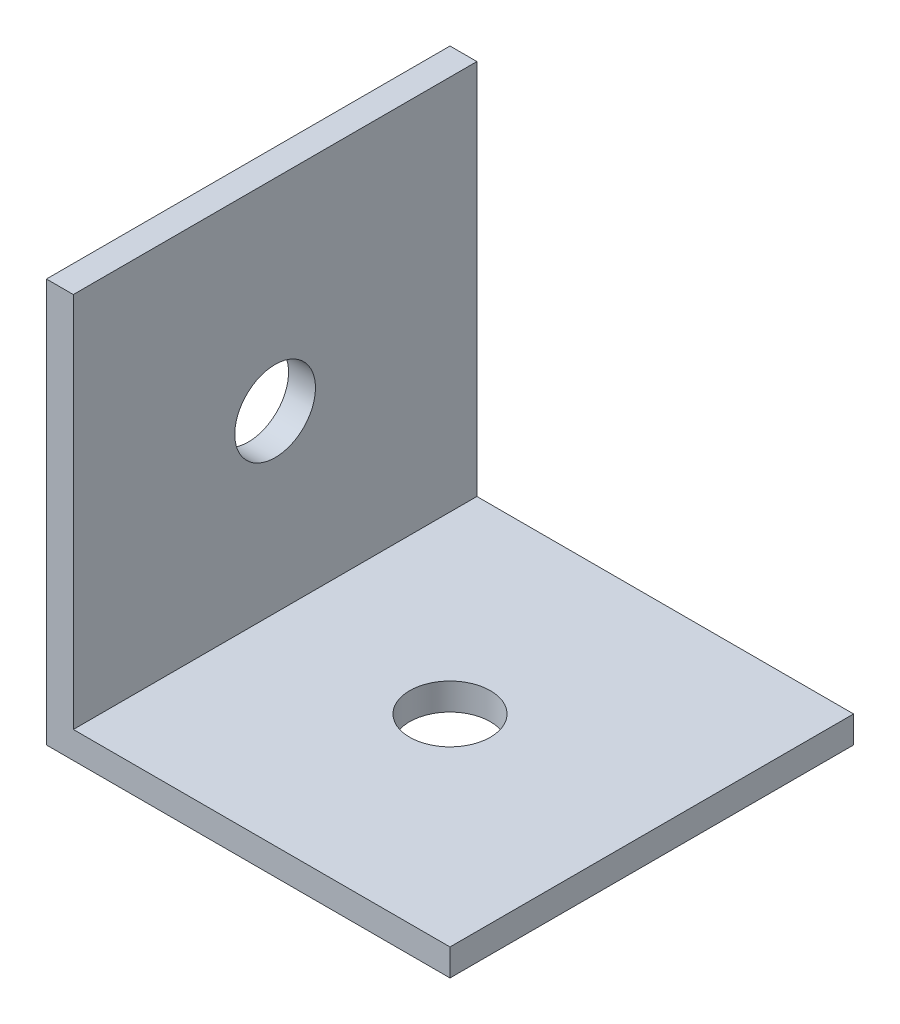
ISO-10303-21;
HEADER;
FILE_DESCRIPTION(('STEP AP214'),'2;1');
FILE_NAME('part.step','',(''),(''),'','','');
FILE_SCHEMA(('AUTOMOTIVE_DESIGN { 1 0 10303 214 1 1 1 1 }'));
ENDSEC;
DATA;
#1=APPLICATION_CONTEXT('core data for automotive mechanical design processes');
#2=APPLICATION_PROTOCOL_DEFINITION('international standard','automotive_design',2000,#1);
#3=PRODUCT_CONTEXT('',#1,'mechanical');
#4=PRODUCT('Part','Part','',(#3));
#5=PRODUCT_RELATED_PRODUCT_CATEGORY('part','',(#4));
#6=PRODUCT_DEFINITION_FORMATION('','',#4);
#7=PRODUCT_DEFINITION_CONTEXT('part definition',#1,'design');
#8=PRODUCT_DEFINITION('design','',#6,#7);
#9=PRODUCT_DEFINITION_SHAPE('','',#8);
#10=(LENGTH_UNIT() NAMED_UNIT(*) SI_UNIT(.MILLI.,.METRE.));
#11=(NAMED_UNIT(*) PLANE_ANGLE_UNIT() SI_UNIT($,.RADIAN.));
#12=(NAMED_UNIT(*) SI_UNIT($,.STERADIAN.) SOLID_ANGLE_UNIT());
#13=UNCERTAINTY_MEASURE_WITH_UNIT(LENGTH_MEASURE(1.E-05),#10,'distance_accuracy_value','');
#14=(GEOMETRIC_REPRESENTATION_CONTEXT(3) GLOBAL_UNCERTAINTY_ASSIGNED_CONTEXT((#13)) GLOBAL_UNIT_ASSIGNED_CONTEXT((#10,
#11,#12)) REPRESENTATION_CONTEXT('',''));
#15=CARTESIAN_POINT('',(0.,0.,0.));
#16=DIRECTION('',(0.,0.,1.));
#17=DIRECTION('',(1.,0.,0.));
#18=AXIS2_PLACEMENT_3D('',#15,#16,#17);
#19=CARTESIAN_POINT('',(-4.46145577395577,0.,15.));
#20=DIRECTION('',(1.,0.,0.));
#21=DIRECTION('',(0.,1.,0.));
#22=AXIS2_PLACEMENT_3D('',#19,#20,#21);
#23=PLANE('',#22);
#24=CARTESIAN_POINT('',(-4.46145577395577,-1.14669421487603,7.5));
#25=DIRECTION('',(1.,0.,0.));
#26=DIRECTION('',(0.,1.,0.));
#27=AXIS2_PLACEMENT_3D('',#24,#25,#26);
#28=CIRCLE('',#27,1.5);
#29=CARTESIAN_POINT('',(-4.46145577395577,0.353305785123968,7.5));
#30=VERTEX_POINT('',#29);
#31=EDGE_CURVE('E122',#30,#30,#28,.T.);
#32=ORIENTED_EDGE('',*,*,#31,.F.);
#33=EDGE_LOOP('',(#32));
#34=FACE_BOUND('',#33,.T.);
#35=DIRECTION('',(0.,-1.,0.));
#36=VECTOR('',#35,1.);
#37=CARTESIAN_POINT('',(-4.46145577395577,0.,0.));
#38=LINE('',#37,#36);
#39=CARTESIAN_POINT('',(-4.46145577395577,6.35330578512397,0.));
#40=VERTEX_POINT('',#39);
#41=CARTESIAN_POINT('',(-4.46145577395577,-7.64669421487603,0.));
#42=VERTEX_POINT('',#41);
#43=EDGE_CURVE('E118',#40,#42,#38,.T.);
#44=ORIENTED_EDGE('',*,*,#43,.F.);
#45=DIRECTION('',(0.,0.,-1.));
#46=VECTOR('',#45,1.);
#47=CARTESIAN_POINT('',(-4.46145577395577,6.35330578512397,15.));
#48=LINE('',#47,#46);
#49=CARTESIAN_POINT('',(-4.46145577395577,6.35330578512397,15.));
#50=VERTEX_POINT('',#49);
#51=EDGE_CURVE('E11',#50,#40,#48,.T.);
#52=ORIENTED_EDGE('',*,*,#51,.F.);
#53=DIRECTION('',(0.,-1.,0.));
#54=VECTOR('',#53,1.);
#55=CARTESIAN_POINT('',(-4.46145577395577,0.,15.));
#56=LINE('',#55,#54);
#57=CARTESIAN_POINT('',(-4.46145577395577,-7.64669421487603,15.));
#58=VERTEX_POINT('',#57);
#59=EDGE_CURVE('E132',#50,#58,#56,.T.);
#60=ORIENTED_EDGE('',*,*,#59,.T.);
#61=DIRECTION('',(0.,0.,-1.));
#62=VECTOR('',#61,1.);
#63=CARTESIAN_POINT('',(-4.46145577395577,-7.64669421487603,15.));
#64=LINE('',#63,#62);
#65=EDGE_CURVE('E80',#58,#42,#64,.T.);
#66=ORIENTED_EDGE('',*,*,#65,.T.);
#67=EDGE_LOOP('',(#44,#52,#60,#66));
#68=FACE_BOUND('',#67,.T.);
#69=ADVANCED_FACE('F35',(#34,#68),#23,.T.);
#70=CARTESIAN_POINT('',(0.,6.35330578512397,15.));
#71=DIRECTION('',(0.,1.,0.));
#72=DIRECTION('',(-1.,0.,0.));
#73=AXIS2_PLACEMENT_3D('',#70,#71,#72);
#74=PLANE('',#73);
#75=DIRECTION('',(1.,0.,0.));
#76=VECTOR('',#75,1.);
#77=CARTESIAN_POINT('',(0.,6.35330578512397,0.));
#78=LINE('',#77,#76);
#79=CARTESIAN_POINT('',(-5.46145577395577,6.35330578512397,0.));
#80=VERTEX_POINT('',#79);
#81=EDGE_CURVE('E121',#80,#40,#78,.T.);
#82=ORIENTED_EDGE('',*,*,#81,.F.);
#83=DIRECTION('',(0.,0.,-1.));
#84=VECTOR('',#83,1.);
#85=CARTESIAN_POINT('',(-5.46145577395577,6.35330578512397,15.));
#86=LINE('',#85,#84);
#87=CARTESIAN_POINT('',(-5.46145577395577,6.35330578512397,15.));
#88=VERTEX_POINT('',#87);
#89=EDGE_CURVE('E44',#88,#80,#86,.T.);
#90=ORIENTED_EDGE('',*,*,#89,.F.);
#91=DIRECTION('',(1.,0.,0.));
#92=VECTOR('',#91,1.);
#93=CARTESIAN_POINT('',(0.,6.35330578512397,15.));
#94=LINE('',#93,#92);
#95=EDGE_CURVE('E145',#88,#50,#94,.T.);
#96=ORIENTED_EDGE('',*,*,#95,.T.);
#97=ORIENTED_EDGE('',*,*,#51,.T.);
#98=EDGE_LOOP('',(#82,#90,#96,#97));
#99=FACE_BOUND('',#98,.T.);
#100=ADVANCED_FACE('F144',(#99),#74,.T.);
#101=CARTESIAN_POINT('',(-5.46145577395577,0.,15.));
#102=DIRECTION('',(1.,0.,0.));
#103=DIRECTION('',(0.,0.,-1.));
#104=AXIS2_PLACEMENT_3D('',#101,#102,#103);
#105=PLANE('',#104);
#106=CARTESIAN_POINT('',(-5.46145577395577,-1.14669421487603,7.5));
#107=DIRECTION('',(-1.,0.,0.));
#108=DIRECTION('',(0.,0.,1.));
#109=AXIS2_PLACEMENT_3D('',#106,#107,#108);
#110=CIRCLE('',#109,1.5);
#111=CARTESIAN_POINT('',(-5.46145577395577,-1.14669421487603,9.));
#112=VERTEX_POINT('',#111);
#113=EDGE_CURVE('E152',#112,#112,#110,.T.);
#114=ORIENTED_EDGE('',*,*,#113,.F.);
#115=EDGE_LOOP('',(#114));
#116=FACE_BOUND('',#115,.T.);
#117=DIRECTION('',(0.,-1.,0.));
#118=VECTOR('',#117,1.);
#119=CARTESIAN_POINT('',(-5.46145577395577,0.,0.));
#120=LINE('',#119,#118);
#121=CARTESIAN_POINT('',(-5.46145577395577,-8.64669421487603,0.));
#122=VERTEX_POINT('',#121);
#123=EDGE_CURVE('E125',#80,#122,#120,.T.);
#124=ORIENTED_EDGE('',*,*,#123,.T.);
#125=DIRECTION('',(0.,0.,-1.));
#126=VECTOR('',#125,1.);
#127=CARTESIAN_POINT('',(-5.46145577395577,-8.64669421487603,15.));
#128=LINE('',#127,#126);
#129=CARTESIAN_POINT('',(-5.46145577395577,-8.64669421487603,15.));
#130=VERTEX_POINT('',#129);
#131=EDGE_CURVE('E111',#130,#122,#128,.T.);
#132=ORIENTED_EDGE('',*,*,#131,.F.);
#133=DIRECTION('',(0.,-1.,0.));
#134=VECTOR('',#133,1.);
#135=CARTESIAN_POINT('',(-5.46145577395577,0.,15.));
#136=LINE('',#135,#134);
#137=EDGE_CURVE('E98',#88,#130,#136,.T.);
#138=ORIENTED_EDGE('',*,*,#137,.F.);
#139=ORIENTED_EDGE('',*,*,#89,.T.);
#140=EDGE_LOOP('',(#124,#132,#138,#139));
#141=FACE_BOUND('',#140,.T.);
#142=ADVANCED_FACE('F138',(#116,#141),#105,.F.);
#143=CARTESIAN_POINT('',(0.,-8.64669421487603,15.));
#144=DIRECTION('',(0.,1.,0.));
#145=DIRECTION('',(0.,0.,1.));
#146=AXIS2_PLACEMENT_3D('',#143,#144,#145);
#147=PLANE('',#146);
#148=CARTESIAN_POINT('',(2.03854422604423,-8.64669421487603,7.5));
#149=DIRECTION('',(0.,-1.,0.));
#150=DIRECTION('',(0.,0.,-1.));
#151=AXIS2_PLACEMENT_3D('',#148,#149,#150);
#152=CIRCLE('',#151,1.5);
#153=CARTESIAN_POINT('',(2.03854422604423,-8.64669421487603,6.));
#154=VERTEX_POINT('',#153);
#155=EDGE_CURVE('E155',#154,#154,#152,.T.);
#156=ORIENTED_EDGE('',*,*,#155,.F.);
#157=EDGE_LOOP('',(#156));
#158=FACE_BOUND('',#157,.T.);
#159=DIRECTION('',(1.,0.,0.));
#160=VECTOR('',#159,1.);
#161=CARTESIAN_POINT('',(0.,-8.64669421487603,0.));
#162=LINE('',#161,#160);
#163=CARTESIAN_POINT('',(9.53854422604423,-8.64669421487603,0.));
#164=VERTEX_POINT('',#163);
#165=EDGE_CURVE('E107',#122,#164,#162,.T.);
#166=ORIENTED_EDGE('',*,*,#165,.T.);
#167=DIRECTION('',(0.,0.,-1.));
#168=VECTOR('',#167,1.);
#169=CARTESIAN_POINT('',(9.53854422604423,-8.64669421487603,15.));
#170=LINE('',#169,#168);
#171=CARTESIAN_POINT('',(9.53854422604423,-8.64669421487603,15.));
#172=VERTEX_POINT('',#171);
#173=EDGE_CURVE('E104',#172,#164,#170,.T.);
#174=ORIENTED_EDGE('',*,*,#173,.F.);
#175=DIRECTION('',(1.,0.,0.));
#176=VECTOR('',#175,1.);
#177=CARTESIAN_POINT('',(0.,-8.64669421487603,15.));
#178=LINE('',#177,#176);
#179=EDGE_CURVE('E91',#130,#172,#178,.T.);
#180=ORIENTED_EDGE('',*,*,#179,.F.);
#181=ORIENTED_EDGE('',*,*,#131,.T.);
#182=EDGE_LOOP('',(#166,#174,#180,#181));
#183=FACE_BOUND('',#182,.T.);
#184=ADVANCED_FACE('F105',(#158,#183),#147,.F.);
#185=CARTESIAN_POINT('',(9.53854422604423,0.,15.));
#186=DIRECTION('',(1.,0.,0.));
#187=DIRECTION('',(0.,1.,0.));
#188=AXIS2_PLACEMENT_3D('',#185,#186,#187);
#189=PLANE('',#188);
#190=DIRECTION('',(0.,-1.,0.));
#191=VECTOR('',#190,1.);
#192=CARTESIAN_POINT('',(9.53854422604423,0.,0.));
#193=LINE('',#192,#191);
#194=CARTESIAN_POINT('',(9.53854422604423,-7.64669421487603,0.));
#195=VERTEX_POINT('',#194);
#196=EDGE_CURVE('E128',#195,#164,#193,.T.);
#197=ORIENTED_EDGE('',*,*,#196,.F.);
#198=DIRECTION('',(0.,0.,-1.));
#199=VECTOR('',#198,1.);
#200=CARTESIAN_POINT('',(9.53854422604423,-7.64669421487603,15.));
#201=LINE('',#200,#199);
#202=CARTESIAN_POINT('',(9.53854422604423,-7.64669421487603,15.));
#203=VERTEX_POINT('',#202);
#204=EDGE_CURVE('E73',#203,#195,#201,.T.);
#205=ORIENTED_EDGE('',*,*,#204,.F.);
#206=DIRECTION('',(0.,-1.,0.));
#207=VECTOR('',#206,1.);
#208=CARTESIAN_POINT('',(9.53854422604423,0.,15.));
#209=LINE('',#208,#207);
#210=EDGE_CURVE('E95',#203,#172,#209,.T.);
#211=ORIENTED_EDGE('',*,*,#210,.T.);
#212=ORIENTED_EDGE('',*,*,#173,.T.);
#213=EDGE_LOOP('',(#197,#205,#211,#212));
#214=FACE_BOUND('',#213,.T.);
#215=ADVANCED_FACE('F113',(#214),#189,.T.);
#216=CARTESIAN_POINT('',(0.,-7.64669421487603,15.));
#217=DIRECTION('',(0.,-1.,0.));
#218=DIRECTION('',(1.,0.,0.));
#219=AXIS2_PLACEMENT_3D('',#216,#217,#218);
#220=PLANE('',#219);
#221=CARTESIAN_POINT('',(2.03854422604423,-7.64669421487603,7.5));
#222=DIRECTION('',(0.,-1.,0.));
#223=DIRECTION('',(1.,0.,0.));
#224=AXIS2_PLACEMENT_3D('',#221,#222,#223);
#225=CIRCLE('',#224,1.5);
#226=CARTESIAN_POINT('',(3.53854422604423,-7.64669421487603,7.5));
#227=VERTEX_POINT('',#226);
#228=EDGE_CURVE('E38',#227,#227,#225,.T.);
#229=ORIENTED_EDGE('',*,*,#228,.T.);
#230=EDGE_LOOP('',(#229));
#231=FACE_BOUND('',#230,.T.);
#232=DIRECTION('',(-1.,0.,0.));
#233=VECTOR('',#232,1.);
#234=CARTESIAN_POINT('',(0.,-7.64669421487603,0.));
#235=LINE('',#234,#233);
#236=EDGE_CURVE('E130',#195,#42,#235,.T.);
#237=ORIENTED_EDGE('',*,*,#236,.T.);
#238=ORIENTED_EDGE('',*,*,#65,.F.);
#239=DIRECTION('',(-1.,0.,0.));
#240=VECTOR('',#239,1.);
#241=CARTESIAN_POINT('',(0.,-7.64669421487603,15.));
#242=LINE('',#241,#240);
#243=EDGE_CURVE('E52',#203,#58,#242,.T.);
#244=ORIENTED_EDGE('',*,*,#243,.F.);
#245=ORIENTED_EDGE('',*,*,#204,.T.);
#246=EDGE_LOOP('',(#237,#238,#244,#245));
#247=FACE_BOUND('',#246,.T.);
#248=ADVANCED_FACE('F146',(#231,#247),#220,.F.);
#249=CARTESIAN_POINT('',(0.,0.,15.));
#250=DIRECTION('',(0.,0.,1.));
#251=DIRECTION('',(1.,0.,0.));
#252=AXIS2_PLACEMENT_3D('',#249,#250,#251);
#253=PLANE('',#252);
#254=ORIENTED_EDGE('',*,*,#59,.F.);
#255=ORIENTED_EDGE('',*,*,#95,.F.);
#256=ORIENTED_EDGE('',*,*,#137,.T.);
#257=ORIENTED_EDGE('',*,*,#179,.T.);
#258=ORIENTED_EDGE('',*,*,#210,.F.);
#259=ORIENTED_EDGE('',*,*,#243,.T.);
#260=EDGE_LOOP('',(#254,#255,#256,#257,#258,#259));
#261=FACE_BOUND('',#260,.T.);
#262=ADVANCED_FACE('F93',(#261),#253,.T.);
#263=CARTESIAN_POINT('',(0.,0.,0.));
#264=DIRECTION('',(0.,0.,1.));
#265=DIRECTION('',(1.,0.,0.));
#266=AXIS2_PLACEMENT_3D('',#263,#264,#265);
#267=PLANE('',#266);
#268=ORIENTED_EDGE('',*,*,#43,.T.);
#269=ORIENTED_EDGE('',*,*,#236,.F.);
#270=ORIENTED_EDGE('',*,*,#196,.T.);
#271=ORIENTED_EDGE('',*,*,#165,.F.);
#272=ORIENTED_EDGE('',*,*,#123,.F.);
#273=ORIENTED_EDGE('',*,*,#81,.T.);
#274=EDGE_LOOP('',(#268,#269,#270,#271,#272,#273));
#275=FACE_BOUND('',#274,.T.);
#276=ADVANCED_FACE('F143',(#275),#267,.F.);
#277=CARTESIAN_POINT('',(4.53854422604423,-1.14669421487603,7.5));
#278=DIRECTION('',(-1.,0.,0.));
#279=DIRECTION('',(0.,0.,1.));
#280=AXIS2_PLACEMENT_3D('',#277,#278,#279);
#281=CYLINDRICAL_SURFACE('',#280,1.5);
#282=ORIENTED_EDGE('',*,*,#31,.T.);
#283=EDGE_LOOP('',(#282));
#284=FACE_BOUND('',#283,.T.);
#285=ORIENTED_EDGE('',*,*,#113,.T.);
#286=EDGE_LOOP('',(#285));
#287=FACE_BOUND('',#286,.T.);
#288=ADVANCED_FACE('F165',(#284,#287),#281,.F.);
#289=CARTESIAN_POINT('',(2.03854422604423,1.35330578512397,7.5));
#290=DIRECTION('',(0.,-1.,0.));
#291=DIRECTION('',(0.,0.,-1.));
#292=AXIS2_PLACEMENT_3D('',#289,#290,#291);
#293=CYLINDRICAL_SURFACE('',#292,1.5);
#294=ORIENTED_EDGE('',*,*,#155,.T.);
#295=EDGE_LOOP('',(#294));
#296=FACE_BOUND('',#295,.T.);
#297=ORIENTED_EDGE('',*,*,#228,.F.);
#298=EDGE_LOOP('',(#297));
#299=FACE_BOUND('',#298,.T.);
#300=ADVANCED_FACE('F163',(#296,#299),#293,.F.);
#301=CLOSED_SHELL('',(#69,#100,#142,#184,#215,#248,#262,#276,#288,#300));
#302=MANIFOLD_SOLID_BREP('B2',#301);
#303=ADVANCED_BREP_SHAPE_REPRESENTATION('',(#18,#302),#14);
#304=SHAPE_DEFINITION_REPRESENTATION(#9,#303);
ENDSEC;
END-ISO-10303-21;
